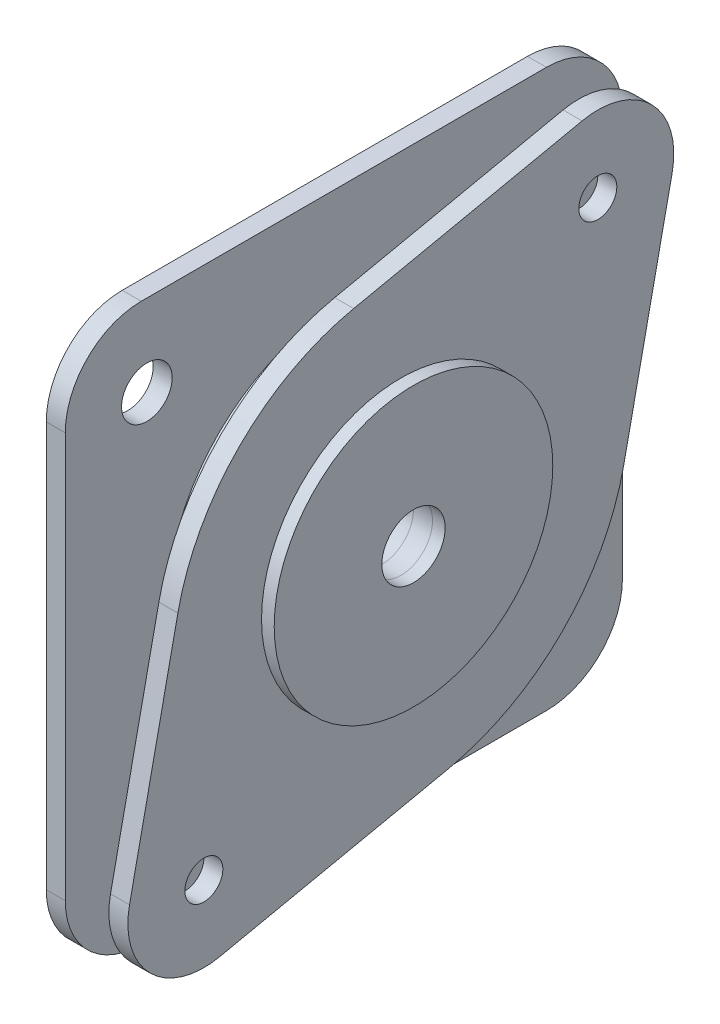
ISO-10303-21;
HEADER;
FILE_DESCRIPTION(('STEP AP214'),'2;1');
FILE_NAME('part.step','',(''),(''),'','','');
FILE_SCHEMA(('AUTOMOTIVE_DESIGN { 1 0 10303 214 1 1 1 1 }'));
ENDSEC;
DATA;
#1=APPLICATION_CONTEXT('core data for automotive mechanical design processes');
#2=APPLICATION_PROTOCOL_DEFINITION('international standard','automotive_design',2000,#1);
#3=PRODUCT_CONTEXT('',#1,'mechanical');
#4=PRODUCT('Part','Part','',(#3));
#5=PRODUCT_RELATED_PRODUCT_CATEGORY('part','',(#4));
#6=PRODUCT_DEFINITION_FORMATION('','',#4);
#7=PRODUCT_DEFINITION_CONTEXT('part definition',#1,'design');
#8=PRODUCT_DEFINITION('design','',#6,#7);
#9=PRODUCT_DEFINITION_SHAPE('','',#8);
#10=(LENGTH_UNIT() NAMED_UNIT(*) SI_UNIT(.MILLI.,.METRE.));
#11=(NAMED_UNIT(*) PLANE_ANGLE_UNIT() SI_UNIT($,.RADIAN.));
#12=(NAMED_UNIT(*) SI_UNIT($,.STERADIAN.) SOLID_ANGLE_UNIT());
#13=UNCERTAINTY_MEASURE_WITH_UNIT(LENGTH_MEASURE(1.E-05),#10,'distance_accuracy_value','');
#14=(GEOMETRIC_REPRESENTATION_CONTEXT(3) GLOBAL_UNCERTAINTY_ASSIGNED_CONTEXT((#13)) GLOBAL_UNIT_ASSIGNED_CONTEXT((#10,
#11,#12)) REPRESENTATION_CONTEXT('',''));
#15=CARTESIAN_POINT('',(0.,0.,0.));
#16=DIRECTION('',(0.,0.,1.));
#17=DIRECTION('',(1.,0.,0.));
#18=AXIS2_PLACEMENT_3D('',#15,#16,#17);
#19=CARTESIAN_POINT('',(1.5,-16.,16.));
#20=DIRECTION('',(1.,0.,0.));
#21=DIRECTION('',(0.,0.,-1.));
#22=AXIS2_PLACEMENT_3D('',#19,#20,#21);
#23=PLANE('',#22);
#24=CARTESIAN_POINT('',(1.5,15.5563491861015,15.556349186104));
#25=DIRECTION('',(1.,0.,0.));
#26=DIRECTION('',(0.,0.,-1.));
#27=AXIS2_PLACEMENT_3D('',#24,#25,#26);
#28=CIRCLE('',#27,2.0000000000026);
#29=CARTESIAN_POINT('',(1.5,15.5563491861015,13.5563491861014));
#30=VERTEX_POINT('',#29);
#31=EDGE_CURVE('E433',#30,#30,#28,.T.);
#32=ORIENTED_EDGE('',*,*,#31,.F.);
#33=EDGE_LOOP('',(#32));
#34=FACE_BOUND('',#33,.T.);
#35=CARTESIAN_POINT('',(1.5,-15.5563491861066,15.5563491861015));
#36=DIRECTION('',(1.,0.,0.));
#37=DIRECTION('',(0.,0.,-1.));
#38=AXIS2_PLACEMENT_3D('',#35,#36,#37);
#39=CIRCLE('',#38,2.0000000000018);
#40=CARTESIAN_POINT('',(1.5,-15.5563491861066,13.5563491860997));
#41=VERTEX_POINT('',#40);
#42=EDGE_CURVE('E503',#41,#41,#39,.T.);
#43=ORIENTED_EDGE('',*,*,#42,.F.);
#44=EDGE_LOOP('',(#43));
#45=FACE_BOUND('',#44,.T.);
#46=CARTESIAN_POINT('',(1.5,-15.5563491861041,-15.5563491861066));
#47=DIRECTION('',(1.,0.,0.));
#48=DIRECTION('',(0.,0.,-1.));
#49=AXIS2_PLACEMENT_3D('',#46,#47,#48);
#50=CIRCLE('',#49,1.99999999999927);
#51=CARTESIAN_POINT('',(1.5,-15.5563491861041,-17.5563491861059));
#52=VERTEX_POINT('',#51);
#53=EDGE_CURVE('E506',#52,#52,#50,.T.);
#54=ORIENTED_EDGE('',*,*,#53,.F.);
#55=EDGE_LOOP('',(#54));
#56=FACE_BOUND('',#55,.T.);
#57=CARTESIAN_POINT('',(1.5,15.556349186104,-15.5563491861041));
#58=DIRECTION('',(1.,0.,0.));
#59=DIRECTION('',(0.,0.,-1.));
#60=AXIS2_PLACEMENT_3D('',#57,#58,#59);
#61=CIRCLE('',#60,2.);
#62=CARTESIAN_POINT('',(1.5,15.556349186104,-17.5563491861041));
#63=VERTEX_POINT('',#62);
#64=EDGE_CURVE('E496',#63,#63,#61,.T.);
#65=ORIENTED_EDGE('',*,*,#64,.F.);
#66=EDGE_LOOP('',(#65));
#67=FACE_BOUND('',#66,.T.);
#68=CARTESIAN_POINT('',(1.5,0.,0.));
#69=DIRECTION('',(1.,0.,0.));
#70=DIRECTION('',(0.,0.,-1.));
#71=AXIS2_PLACEMENT_3D('',#68,#69,#70);
#72=CIRCLE('',#71,14.);
#73=CARTESIAN_POINT('',(1.5,0.,-14.));
#74=VERTEX_POINT('',#73);
#75=EDGE_CURVE('E45',#74,#74,#72,.T.);
#76=ORIENTED_EDGE('',*,*,#75,.F.);
#77=EDGE_LOOP('',(#76));
#78=FACE_BOUND('',#77,.T.);
#79=CARTESIAN_POINT('',(1.5,-16.,16.));
#80=DIRECTION('',(1.,0.,0.));
#81=DIRECTION('',(0.,0.,-1.));
#82=AXIS2_PLACEMENT_3D('',#79,#80,#81);
#83=CIRCLE('',#82,6.);
#84=CARTESIAN_POINT('',(1.5,-16.,22.));
#85=VERTEX_POINT('',#84);
#86=CARTESIAN_POINT('',(1.5,-22.,16.));
#87=VERTEX_POINT('',#86);
#88=EDGE_CURVE('E153',#85,#87,#83,.T.);
#89=ORIENTED_EDGE('',*,*,#88,.T.);
#90=DIRECTION('',(0.,0.,-1.));
#91=VECTOR('',#90,1.);
#92=CARTESIAN_POINT('',(1.5,-22.,16.));
#93=LINE('',#92,#91);
#94=CARTESIAN_POINT('',(1.5,-22.,-16.));
#95=VERTEX_POINT('',#94);
#96=EDGE_CURVE('E99',#87,#95,#93,.T.);
#97=ORIENTED_EDGE('',*,*,#96,.T.);
#98=CARTESIAN_POINT('',(1.5,-16.,-16.));
#99=DIRECTION('',(1.,0.,0.));
#100=DIRECTION('',(0.,0.,-1.));
#101=AXIS2_PLACEMENT_3D('',#98,#99,#100);
#102=CIRCLE('',#101,6.);
#103=CARTESIAN_POINT('',(1.5,-16.,-22.));
#104=VERTEX_POINT('',#103);
#105=EDGE_CURVE('E229',#95,#104,#102,.T.);
#106=ORIENTED_EDGE('',*,*,#105,.T.);
#107=DIRECTION('',(0.,1.,0.));
#108=VECTOR('',#107,1.);
#109=CARTESIAN_POINT('',(1.5,16.,-22.));
#110=LINE('',#109,#108);
#111=CARTESIAN_POINT('',(1.5,16.,-22.));
#112=VERTEX_POINT('',#111);
#113=EDGE_CURVE('E235',#104,#112,#110,.T.);
#114=ORIENTED_EDGE('',*,*,#113,.T.);
#115=CARTESIAN_POINT('',(1.5,16.,-16.));
#116=DIRECTION('',(1.,0.,0.));
#117=DIRECTION('',(0.,0.,1.));
#118=AXIS2_PLACEMENT_3D('',#115,#116,#117);
#119=CIRCLE('',#118,6.);
#120=CARTESIAN_POINT('',(1.5,22.,-16.));
#121=VERTEX_POINT('',#120);
#122=EDGE_CURVE('E120',#112,#121,#119,.T.);
#123=ORIENTED_EDGE('',*,*,#122,.T.);
#124=DIRECTION('',(0.,0.,1.));
#125=VECTOR('',#124,1.);
#126=CARTESIAN_POINT('',(1.5,22.,16.));
#127=LINE('',#126,#125);
#128=CARTESIAN_POINT('',(1.5,22.,16.));
#129=VERTEX_POINT('',#128);
#130=EDGE_CURVE('E115',#121,#129,#127,.T.);
#131=ORIENTED_EDGE('',*,*,#130,.T.);
#132=CARTESIAN_POINT('',(1.5,16.,16.));
#133=DIRECTION('',(1.,0.,0.));
#134=DIRECTION('',(0.,0.,-1.));
#135=AXIS2_PLACEMENT_3D('',#132,#133,#134);
#136=CIRCLE('',#135,6.);
#137=CARTESIAN_POINT('',(1.5,16.,22.));
#138=VERTEX_POINT('',#137);
#139=EDGE_CURVE('E118',#129,#138,#136,.T.);
#140=ORIENTED_EDGE('',*,*,#139,.T.);
#141=DIRECTION('',(0.,-1.,0.));
#142=VECTOR('',#141,1.);
#143=CARTESIAN_POINT('',(1.5,16.,22.));
#144=LINE('',#143,#142);
#145=EDGE_CURVE('E54',#138,#85,#144,.T.);
#146=ORIENTED_EDGE('',*,*,#145,.T.);
#147=EDGE_LOOP('',(#89,#97,#106,#114,#123,#131,#140,#146));
#148=FACE_BOUND('',#147,.T.);
#149=ADVANCED_FACE('F33',(#34,#45,#56,#67,#78,#148),#23,.T.);
#150=CARTESIAN_POINT('',(0.,-16.,16.));
#151=DIRECTION('',(1.,0.,0.));
#152=DIRECTION('',(0.,0.,-1.));
#153=AXIS2_PLACEMENT_3D('',#150,#151,#152);
#154=PLANE('',#153);
#155=CARTESIAN_POINT('',(0.,15.5563491861015,15.556349186104));
#156=DIRECTION('',(1.,0.,0.));
#157=DIRECTION('',(0.,0.,-1.));
#158=AXIS2_PLACEMENT_3D('',#155,#156,#157);
#159=CIRCLE('',#158,2.0000000000026);
#160=CARTESIAN_POINT('',(0.,15.5563491861015,13.5563491861014));
#161=VERTEX_POINT('',#160);
#162=EDGE_CURVE('E438',#161,#161,#159,.T.);
#163=ORIENTED_EDGE('',*,*,#162,.T.);
#164=EDGE_LOOP('',(#163));
#165=FACE_BOUND('',#164,.T.);
#166=CARTESIAN_POINT('',(0.,-15.5563491861066,15.5563491861015));
#167=DIRECTION('',(1.,0.,0.));
#168=DIRECTION('',(0.,0.,-1.));
#169=AXIS2_PLACEMENT_3D('',#166,#167,#168);
#170=CIRCLE('',#169,2.0000000000018);
#171=CARTESIAN_POINT('',(0.,-15.5563491861066,13.5563491860997));
#172=VERTEX_POINT('',#171);
#173=EDGE_CURVE('E500',#172,#172,#170,.T.);
#174=ORIENTED_EDGE('',*,*,#173,.T.);
#175=EDGE_LOOP('',(#174));
#176=FACE_BOUND('',#175,.T.);
#177=CARTESIAN_POINT('',(0.,-15.5563491861041,-15.5563491861066));
#178=DIRECTION('',(1.,0.,0.));
#179=DIRECTION('',(0.,0.,-1.));
#180=AXIS2_PLACEMENT_3D('',#177,#178,#179);
#181=CIRCLE('',#180,1.99999999999927);
#182=CARTESIAN_POINT('',(0.,-15.5563491861041,-17.5563491861059));
#183=VERTEX_POINT('',#182);
#184=EDGE_CURVE('E177',#183,#183,#181,.T.);
#185=ORIENTED_EDGE('',*,*,#184,.T.);
#186=EDGE_LOOP('',(#185));
#187=FACE_BOUND('',#186,.T.);
#188=CARTESIAN_POINT('',(0.,15.556349186104,-15.5563491861041));
#189=DIRECTION('',(1.,0.,0.));
#190=DIRECTION('',(0.,0.,-1.));
#191=AXIS2_PLACEMENT_3D('',#188,#189,#190);
#192=CIRCLE('',#191,2.);
#193=CARTESIAN_POINT('',(0.,15.556349186104,-17.5563491861041));
#194=VERTEX_POINT('',#193);
#195=EDGE_CURVE('E488',#194,#194,#192,.T.);
#196=ORIENTED_EDGE('',*,*,#195,.T.);
#197=EDGE_LOOP('',(#196));
#198=FACE_BOUND('',#197,.T.);
#199=CARTESIAN_POINT('',(0.,-16.,16.));
#200=DIRECTION('',(1.,0.,0.));
#201=DIRECTION('',(0.,0.,-1.));
#202=AXIS2_PLACEMENT_3D('',#199,#200,#201);
#203=CIRCLE('',#202,6.);
#204=CARTESIAN_POINT('',(0.,-16.,22.));
#205=VERTEX_POINT('',#204);
#206=CARTESIAN_POINT('',(0.,-22.,16.));
#207=VERTEX_POINT('',#206);
#208=EDGE_CURVE('E138',#205,#207,#203,.T.);
#209=ORIENTED_EDGE('',*,*,#208,.F.);
#210=DIRECTION('',(0.,-1.,0.));
#211=VECTOR('',#210,1.);
#212=CARTESIAN_POINT('',(0.,16.,22.));
#213=LINE('',#212,#211);
#214=CARTESIAN_POINT('',(0.,16.,22.));
#215=VERTEX_POINT('',#214);
#216=EDGE_CURVE('E90',#215,#205,#213,.T.);
#217=ORIENTED_EDGE('',*,*,#216,.F.);
#218=CARTESIAN_POINT('',(0.,16.,16.));
#219=DIRECTION('',(1.,0.,0.));
#220=DIRECTION('',(0.,0.,-1.));
#221=AXIS2_PLACEMENT_3D('',#218,#219,#220);
#222=CIRCLE('',#221,6.);
#223=CARTESIAN_POINT('',(0.,22.,16.));
#224=VERTEX_POINT('',#223);
#225=EDGE_CURVE('E84',#224,#215,#222,.T.);
#226=ORIENTED_EDGE('',*,*,#225,.F.);
#227=DIRECTION('',(0.,0.,1.));
#228=VECTOR('',#227,1.);
#229=CARTESIAN_POINT('',(0.,22.,16.));
#230=LINE('',#229,#228);
#231=CARTESIAN_POINT('',(0.,22.,-16.));
#232=VERTEX_POINT('',#231);
#233=EDGE_CURVE('E128',#232,#224,#230,.T.);
#234=ORIENTED_EDGE('',*,*,#233,.F.);
#235=CARTESIAN_POINT('',(0.,16.,-16.));
#236=DIRECTION('',(1.,0.,0.));
#237=DIRECTION('',(0.,0.,1.));
#238=AXIS2_PLACEMENT_3D('',#235,#236,#237);
#239=CIRCLE('',#238,6.);
#240=CARTESIAN_POINT('',(0.,16.,-22.));
#241=VERTEX_POINT('',#240);
#242=EDGE_CURVE('E148',#241,#232,#239,.T.);
#243=ORIENTED_EDGE('',*,*,#242,.F.);
#244=DIRECTION('',(0.,1.,0.));
#245=VECTOR('',#244,1.);
#246=CARTESIAN_POINT('',(0.,16.,-22.));
#247=LINE('',#246,#245);
#248=CARTESIAN_POINT('',(0.,-16.,-22.));
#249=VERTEX_POINT('',#248);
#250=EDGE_CURVE('E146',#249,#241,#247,.T.);
#251=ORIENTED_EDGE('',*,*,#250,.F.);
#252=CARTESIAN_POINT('',(0.,-16.,-16.));
#253=DIRECTION('',(1.,0.,0.));
#254=DIRECTION('',(0.,0.,-1.));
#255=AXIS2_PLACEMENT_3D('',#252,#253,#254);
#256=CIRCLE('',#255,6.);
#257=CARTESIAN_POINT('',(0.,-22.,-16.));
#258=VERTEX_POINT('',#257);
#259=EDGE_CURVE('E144',#258,#249,#256,.T.);
#260=ORIENTED_EDGE('',*,*,#259,.F.);
#261=DIRECTION('',(0.,0.,-1.));
#262=VECTOR('',#261,1.);
#263=CARTESIAN_POINT('',(0.,-22.,16.));
#264=LINE('',#263,#262);
#265=EDGE_CURVE('E141',#207,#258,#264,.T.);
#266=ORIENTED_EDGE('',*,*,#265,.F.);
#267=EDGE_LOOP('',(#209,#217,#226,#234,#243,#251,#260,#266));
#268=FACE_BOUND('',#267,.T.);
#269=CARTESIAN_POINT('',(0.,0.,0.));
#270=DIRECTION('',(1.,0.,0.));
#271=DIRECTION('',(0.,0.,-1.));
#272=AXIS2_PLACEMENT_3D('',#269,#270,#271);
#273=CIRCLE('',#272,2.5);
#274=CARTESIAN_POINT('',(0.,0.,-2.5));
#275=VERTEX_POINT('',#274);
#276=EDGE_CURVE('E142',#275,#275,#273,.T.);
#277=ORIENTED_EDGE('',*,*,#276,.T.);
#278=EDGE_LOOP('',(#277));
#279=FACE_BOUND('',#278,.T.);
#280=ADVANCED_FACE('F195',(#165,#176,#187,#198,#268,#279),#154,.F.);
#281=CARTESIAN_POINT('',(1.5,-16.,16.));
#282=DIRECTION('',(-1.,0.,0.));
#283=DIRECTION('',(0.,0.,1.));
#284=AXIS2_PLACEMENT_3D('',#281,#282,#283);
#285=CYLINDRICAL_SURFACE('',#284,6.);
#286=ORIENTED_EDGE('',*,*,#208,.T.);
#287=DIRECTION('',(-1.,0.,0.));
#288=VECTOR('',#287,1.);
#289=CARTESIAN_POINT('',(1.5,-22.,16.));
#290=LINE('',#289,#288);
#291=EDGE_CURVE('E166',#87,#207,#290,.T.);
#292=ORIENTED_EDGE('',*,*,#291,.F.);
#293=ORIENTED_EDGE('',*,*,#88,.F.);
#294=DIRECTION('',(-1.,0.,0.));
#295=VECTOR('',#294,1.);
#296=CARTESIAN_POINT('',(1.5,-16.,22.));
#297=LINE('',#296,#295);
#298=EDGE_CURVE('E134',#85,#205,#297,.T.);
#299=ORIENTED_EDGE('',*,*,#298,.T.);
#300=EDGE_LOOP('',(#286,#292,#293,#299));
#301=FACE_BOUND('',#300,.T.);
#302=ADVANCED_FACE('F35',(#301),#285,.T.);
#303=CARTESIAN_POINT('',(1.5,-22.,16.));
#304=DIRECTION('',(0.,1.,0.));
#305=DIRECTION('',(0.,0.,1.));
#306=AXIS2_PLACEMENT_3D('',#303,#304,#305);
#307=PLANE('',#306);
#308=ORIENTED_EDGE('',*,*,#265,.T.);
#309=DIRECTION('',(-1.,0.,0.));
#310=VECTOR('',#309,1.);
#311=CARTESIAN_POINT('',(1.5,-22.,-16.));
#312=LINE('',#311,#310);
#313=EDGE_CURVE('E163',#95,#258,#312,.T.);
#314=ORIENTED_EDGE('',*,*,#313,.F.);
#315=ORIENTED_EDGE('',*,*,#96,.F.);
#316=ORIENTED_EDGE('',*,*,#291,.T.);
#317=EDGE_LOOP('',(#308,#314,#315,#316));
#318=FACE_BOUND('',#317,.T.);
#319=ADVANCED_FACE('F216',(#318),#307,.F.);
#320=CARTESIAN_POINT('',(1.5,-16.,-16.));
#321=DIRECTION('',(-1.,0.,0.));
#322=DIRECTION('',(0.,0.,1.));
#323=AXIS2_PLACEMENT_3D('',#320,#321,#322);
#324=CYLINDRICAL_SURFACE('',#323,6.);
#325=ORIENTED_EDGE('',*,*,#259,.T.);
#326=DIRECTION('',(-1.,0.,0.));
#327=VECTOR('',#326,1.);
#328=CARTESIAN_POINT('',(1.5,-16.,-22.));
#329=LINE('',#328,#327);
#330=EDGE_CURVE('E160',#104,#249,#329,.T.);
#331=ORIENTED_EDGE('',*,*,#330,.F.);
#332=ORIENTED_EDGE('',*,*,#105,.F.);
#333=ORIENTED_EDGE('',*,*,#313,.T.);
#334=EDGE_LOOP('',(#325,#331,#332,#333));
#335=FACE_BOUND('',#334,.T.);
#336=ADVANCED_FACE('F213',(#335),#324,.T.);
#337=CARTESIAN_POINT('',(1.5,16.,-22.));
#338=DIRECTION('',(0.,0.,1.));
#339=DIRECTION('',(1.,0.,0.));
#340=AXIS2_PLACEMENT_3D('',#337,#338,#339);
#341=PLANE('',#340);
#342=ORIENTED_EDGE('',*,*,#250,.T.);
#343=DIRECTION('',(-1.,0.,0.));
#344=VECTOR('',#343,1.);
#345=CARTESIAN_POINT('',(1.5,16.,-22.));
#346=LINE('',#345,#344);
#347=EDGE_CURVE('E157',#112,#241,#346,.T.);
#348=ORIENTED_EDGE('',*,*,#347,.F.);
#349=ORIENTED_EDGE('',*,*,#113,.F.);
#350=ORIENTED_EDGE('',*,*,#330,.T.);
#351=EDGE_LOOP('',(#342,#348,#349,#350));
#352=FACE_BOUND('',#351,.T.);
#353=ADVANCED_FACE('F209',(#352),#341,.F.);
#354=CARTESIAN_POINT('',(1.5,16.,-16.));
#355=DIRECTION('',(-1.,0.,0.));
#356=DIRECTION('',(0.,0.,1.));
#357=AXIS2_PLACEMENT_3D('',#354,#355,#356);
#358=CYLINDRICAL_SURFACE('',#357,6.);
#359=ORIENTED_EDGE('',*,*,#242,.T.);
#360=DIRECTION('',(-1.,0.,0.));
#361=VECTOR('',#360,1.);
#362=CARTESIAN_POINT('',(1.5,22.,-16.));
#363=LINE('',#362,#361);
#364=EDGE_CURVE('E129',#121,#232,#363,.T.);
#365=ORIENTED_EDGE('',*,*,#364,.F.);
#366=ORIENTED_EDGE('',*,*,#122,.F.);
#367=ORIENTED_EDGE('',*,*,#347,.T.);
#368=EDGE_LOOP('',(#359,#365,#366,#367));
#369=FACE_BOUND('',#368,.T.);
#370=ADVANCED_FACE('F206',(#369),#358,.T.);
#371=CARTESIAN_POINT('',(1.5,22.,16.));
#372=DIRECTION('',(0.,-1.,0.));
#373=DIRECTION('',(0.,0.,-1.));
#374=AXIS2_PLACEMENT_3D('',#371,#372,#373);
#375=PLANE('',#374);
#376=ORIENTED_EDGE('',*,*,#233,.T.);
#377=DIRECTION('',(-1.,0.,0.));
#378=VECTOR('',#377,1.);
#379=CARTESIAN_POINT('',(1.5,22.,16.));
#380=LINE('',#379,#378);
#381=EDGE_CURVE('E125',#129,#224,#380,.T.);
#382=ORIENTED_EDGE('',*,*,#381,.F.);
#383=ORIENTED_EDGE('',*,*,#130,.F.);
#384=ORIENTED_EDGE('',*,*,#364,.T.);
#385=EDGE_LOOP('',(#376,#382,#383,#384));
#386=FACE_BOUND('',#385,.T.);
#387=ADVANCED_FACE('F126',(#386),#375,.F.);
#388=CARTESIAN_POINT('',(1.5,16.,16.));
#389=DIRECTION('',(-1.,0.,0.));
#390=DIRECTION('',(0.,0.,1.));
#391=AXIS2_PLACEMENT_3D('',#388,#389,#390);
#392=CYLINDRICAL_SURFACE('',#391,6.);
#393=ORIENTED_EDGE('',*,*,#225,.T.);
#394=DIRECTION('',(-1.,0.,0.));
#395=VECTOR('',#394,1.);
#396=CARTESIAN_POINT('',(1.5,16.,22.));
#397=LINE('',#396,#395);
#398=EDGE_CURVE('E130',#138,#215,#397,.T.);
#399=ORIENTED_EDGE('',*,*,#398,.F.);
#400=ORIENTED_EDGE('',*,*,#139,.F.);
#401=ORIENTED_EDGE('',*,*,#381,.T.);
#402=EDGE_LOOP('',(#393,#399,#400,#401));
#403=FACE_BOUND('',#402,.T.);
#404=ADVANCED_FACE('F132',(#403),#392,.T.);
#405=CARTESIAN_POINT('',(1.5,16.,22.));
#406=DIRECTION('',(0.,0.,-1.));
#407=DIRECTION('',(-1.,0.,0.));
#408=AXIS2_PLACEMENT_3D('',#405,#406,#407);
#409=PLANE('',#408);
#410=ORIENTED_EDGE('',*,*,#216,.T.);
#411=ORIENTED_EDGE('',*,*,#298,.F.);
#412=ORIENTED_EDGE('',*,*,#145,.F.);
#413=ORIENTED_EDGE('',*,*,#398,.T.);
#414=EDGE_LOOP('',(#410,#411,#412,#413));
#415=FACE_BOUND('',#414,.T.);
#416=ADVANCED_FACE('F190',(#415),#409,.F.);
#417=CARTESIAN_POINT('',(1.5,0.,0.));
#418=DIRECTION('',(-1.,0.,0.));
#419=DIRECTION('',(0.,0.,1.));
#420=AXIS2_PLACEMENT_3D('',#417,#418,#419);
#421=CYLINDRICAL_SURFACE('',#420,2.5);
#422=ORIENTED_EDGE('',*,*,#276,.F.);
#423=EDGE_LOOP('',(#422));
#424=FACE_BOUND('',#423,.T.);
#425=CARTESIAN_POINT('',(4.5,0.,0.));
#426=DIRECTION('',(1.,0.,0.));
#427=DIRECTION('',(0.,0.,1.));
#428=AXIS2_PLACEMENT_3D('',#425,#426,#427);
#429=CIRCLE('',#428,2.5);
#430=CARTESIAN_POINT('',(4.5,0.,2.5));
#431=VERTEX_POINT('',#430);
#432=EDGE_CURVE('E172',#431,#431,#429,.T.);
#433=ORIENTED_EDGE('',*,*,#432,.T.);
#434=EDGE_LOOP('',(#433));
#435=FACE_BOUND('',#434,.T.);
#436=ADVANCED_FACE('F179',(#424,#435),#421,.F.);
#437=CARTESIAN_POINT('',(4.5,0.,0.));
#438=DIRECTION('',(-1.,0.,0.));
#439=DIRECTION('',(0.,0.,1.));
#440=AXIS2_PLACEMENT_3D('',#437,#438,#439);
#441=CYLINDRICAL_SURFACE('',#440,14.);
#442=CARTESIAN_POINT('',(4.5,0.,0.));
#443=DIRECTION('',(1.,0.,0.));
#444=DIRECTION('',(0.,0.,-1.));
#445=AXIS2_PLACEMENT_3D('',#442,#443,#444);
#446=CIRCLE('',#445,14.);
#447=CARTESIAN_POINT('',(4.5,0.,-14.));
#448=VERTEX_POINT('',#447);
#449=EDGE_CURVE('E243',#448,#448,#446,.T.);
#450=ORIENTED_EDGE('',*,*,#449,.F.);
#451=EDGE_LOOP('',(#450));
#452=FACE_BOUND('',#451,.T.);
#453=ORIENTED_EDGE('',*,*,#75,.T.);
#454=EDGE_LOOP('',(#453));
#455=FACE_BOUND('',#454,.T.);
#456=ADVANCED_FACE('F189',(#452,#455),#441,.T.);
#457=CARTESIAN_POINT('',(4.5,0.,-0.002));
#458=DIRECTION('',(1.,0.,0.));
#459=DIRECTION('',(0.,0.,-1.));
#460=AXIS2_PLACEMENT_3D('',#457,#458,#459);
#461=PLANE('',#460);
#462=CARTESIAN_POINT('',(4.5,0.,-0.002));
#463=DIRECTION('',(1.,0.,0.));
#464=DIRECTION('',(0.,0.,-1.));
#465=AXIS2_PLACEMENT_3D('',#462,#463,#464);
#466=CIRCLE('',#465,18.);
#467=CARTESIAN_POINT('',(4.5,17.6102050587483,3.72367816495693));
#468=VERTEX_POINT('',#467);
#469=CARTESIAN_POINT('',(4.5,3.72692559108058,17.6079411026428));
#470=VERTEX_POINT('',#469);
#471=EDGE_CURVE('E312',#468,#470,#466,.T.);
#472=ORIENTED_EDGE('',*,*,#471,.F.);
#473=DIRECTION('',(0.,-0.206982120275385,0.978344725486015));
#474=VECTOR('',#473,1.);
#475=CARTESIAN_POINT('',(4.5,17.6102050587483,3.72367816495693));
#476=LINE('',#475,#474);
#477=CARTESIAN_POINT('',(4.5,21.4264175390201,-14.3144564644518));
#478=VERTEX_POINT('',#477);
#479=EDGE_CURVE('E346',#478,#468,#476,.T.);
#480=ORIENTED_EDGE('',*,*,#479,.F.);
#481=CARTESIAN_POINT('',(4.5,15.556349186104,-15.5563491861041));
#482=DIRECTION('',(1.,0.,0.));
#483=DIRECTION('',(0.,0.,-1.));
#484=AXIS2_PLACEMENT_3D('',#481,#482,#483);
#485=CIRCLE('',#484,6.);
#486=CARTESIAN_POINT('',(4.5,14.3152112078002,-21.42657716454));
#487=VERTEX_POINT('',#486);
#488=EDGE_CURVE('E343',#487,#478,#485,.T.);
#489=ORIENTED_EDGE('',*,*,#488,.F.);
#490=DIRECTION('',(0.,0.978371329739319,-0.20685632971731));
#491=VECTOR('',#490,1.);
#492=CARTESIAN_POINT('',(4.5,-3.72341393491158,-17.6126839353077));
#493=LINE('',#492,#491);
#494=CARTESIAN_POINT('',(4.5,-3.72341393491159,-17.6126839353077));
#495=VERTEX_POINT('',#494);
#496=EDGE_CURVE('E340',#495,#487,#493,.T.);
#497=ORIENTED_EDGE('',*,*,#496,.F.);
#498=CARTESIAN_POINT('',(4.5,0.,-0.002));
#499=DIRECTION('',(1.,0.,0.));
#500=DIRECTION('',(0.,0.,-1.));
#501=AXIS2_PLACEMENT_3D('',#498,#499,#500);
#502=CIRCLE('',#501,18.);
#503=CARTESIAN_POINT('',(4.5,-17.610358594453,-3.72695237214854));
#504=VERTEX_POINT('',#503);
#505=EDGE_CURVE('E337',#504,#495,#502,.T.);
#506=ORIENTED_EDGE('',*,*,#505,.F.);
#507=DIRECTION('',(0.,0.206941798452697,-0.978353255247389));
#508=VECTOR('',#507,1.);
#509=CARTESIAN_POINT('',(4.5,-17.610358594453,-3.72695237214854));
#510=LINE('',#509,#508);
#511=CARTESIAN_POINT('',(4.5,-21.426487839487,14.3144607074678));
#512=VERTEX_POINT('',#511);
#513=EDGE_CURVE('E334',#512,#504,#510,.T.);
#514=ORIENTED_EDGE('',*,*,#513,.F.);
#515=CARTESIAN_POINT('',(4.5,-15.5563683080027,15.556111498184));
#516=DIRECTION('',(1.,0.,0.));
#517=DIRECTION('',(0.,0.,-1.));
#518=AXIS2_PLACEMENT_3D('',#515,#516,#517);
#519=CIRCLE('',#518,6.);
#520=CARTESIAN_POINT('',(4.5,-14.3140597776425,21.4260918657316));
#521=VERTEX_POINT('',#520);
#522=EDGE_CURVE('E325',#521,#512,#519,.T.);
#523=ORIENTED_EDGE('',*,*,#522,.F.);
#524=DIRECTION('',(0.,-0.978330061257934,0.207051421726699));
#525=VECTOR('',#524,1.);
#526=CARTESIAN_POINT('',(4.5,3.72692559108058,17.6079411026428));
#527=LINE('',#526,#525);
#528=EDGE_CURVE('E322',#470,#521,#527,.T.);
#529=ORIENTED_EDGE('',*,*,#528,.F.);
#530=EDGE_LOOP('',(#472,#480,#489,#497,#506,#514,#523,#529));
#531=FACE_BOUND('',#530,.T.);
#532=ORIENTED_EDGE('',*,*,#449,.T.);
#533=EDGE_LOOP('',(#532));
#534=FACE_BOUND('',#533,.T.);
#535=CARTESIAN_POINT('',(4.5,15.556349186104,-15.5563491861041));
#536=DIRECTION('',(1.,0.,0.));
#537=DIRECTION('',(0.,0.,-1.));
#538=AXIS2_PLACEMENT_3D('',#535,#536,#537);
#539=CIRCLE('',#538,1.5);
#540=CARTESIAN_POINT('',(4.5,15.556349186104,-17.0563491861041));
#541=VERTEX_POINT('',#540);
#542=EDGE_CURVE('E386',#541,#541,#539,.T.);
#543=ORIENTED_EDGE('',*,*,#542,.T.);
#544=EDGE_LOOP('',(#543));
#545=FACE_BOUND('',#544,.T.);
#546=CARTESIAN_POINT('',(4.5,-15.5563491861039,15.5543491861042));
#547=DIRECTION('',(1.,0.,0.));
#548=DIRECTION('',(0.,0.,-1.));
#549=AXIS2_PLACEMENT_3D('',#546,#547,#548);
#550=CIRCLE('',#549,1.5);
#551=CARTESIAN_POINT('',(4.5,-15.5563491861039,14.0543491861042));
#552=VERTEX_POINT('',#551);
#553=EDGE_CURVE('E430',#552,#552,#550,.T.);
#554=ORIENTED_EDGE('',*,*,#553,.T.);
#555=EDGE_LOOP('',(#554));
#556=FACE_BOUND('',#555,.T.);
#557=ADVANCED_FACE('F272',(#531,#534,#545,#556),#461,.F.);
#558=CARTESIAN_POINT('',(6.,0.,-0.002));
#559=DIRECTION('',(1.,0.,0.));
#560=DIRECTION('',(0.,0.,-1.));
#561=AXIS2_PLACEMENT_3D('',#558,#559,#560);
#562=PLANE('',#561);
#563=CARTESIAN_POINT('',(6.,0.,0.));
#564=DIRECTION('',(1.,0.,0.));
#565=DIRECTION('',(0.,0.,-1.));
#566=AXIS2_PLACEMENT_3D('',#563,#564,#565);
#567=CIRCLE('',#566,11.);
#568=CARTESIAN_POINT('',(6.,0.,-11.));
#569=VERTEX_POINT('',#568);
#570=EDGE_CURVE('E11',#569,#569,#567,.T.);
#571=ORIENTED_EDGE('',*,*,#570,.F.);
#572=EDGE_LOOP('',(#571));
#573=FACE_BOUND('',#572,.T.);
#574=CARTESIAN_POINT('',(6.,15.556349186104,-15.5563491861041));
#575=DIRECTION('',(1.,0.,0.));
#576=DIRECTION('',(0.,0.,-1.));
#577=AXIS2_PLACEMENT_3D('',#574,#575,#576);
#578=CIRCLE('',#577,1.5);
#579=CARTESIAN_POINT('',(6.,15.556349186104,-17.0563491861041));
#580=VERTEX_POINT('',#579);
#581=EDGE_CURVE('E327',#580,#580,#578,.T.);
#582=ORIENTED_EDGE('',*,*,#581,.F.);
#583=EDGE_LOOP('',(#582));
#584=FACE_BOUND('',#583,.T.);
#585=CARTESIAN_POINT('',(6.,0.,-0.002));
#586=DIRECTION('',(1.,0.,0.));
#587=DIRECTION('',(0.,0.,-1.));
#588=AXIS2_PLACEMENT_3D('',#585,#586,#587);
#589=CIRCLE('',#588,18.);
#590=CARTESIAN_POINT('',(6.,17.6102050587483,3.72367816495693));
#591=VERTEX_POINT('',#590);
#592=CARTESIAN_POINT('',(6.,3.72692559108058,17.6079411026428));
#593=VERTEX_POINT('',#592);
#594=EDGE_CURVE('E349',#591,#593,#589,.T.);
#595=ORIENTED_EDGE('',*,*,#594,.T.);
#596=DIRECTION('',(0.,-0.978330061257934,0.207051421726699));
#597=VECTOR('',#596,1.);
#598=CARTESIAN_POINT('',(6.,3.72692559108058,17.6079411026428));
#599=LINE('',#598,#597);
#600=CARTESIAN_POINT('',(6.,-14.3140597776425,21.4260918657316));
#601=VERTEX_POINT('',#600);
#602=EDGE_CURVE('E371',#593,#601,#599,.T.);
#603=ORIENTED_EDGE('',*,*,#602,.T.);
#604=CARTESIAN_POINT('',(6.,-15.5563683080027,15.556111498184));
#605=DIRECTION('',(1.,0.,0.));
#606=DIRECTION('',(0.,0.,-1.));
#607=AXIS2_PLACEMENT_3D('',#604,#605,#606);
#608=CIRCLE('',#607,6.);
#609=CARTESIAN_POINT('',(6.,-21.426487839487,14.3144607074678));
#610=VERTEX_POINT('',#609);
#611=EDGE_CURVE('E378',#601,#610,#608,.T.);
#612=ORIENTED_EDGE('',*,*,#611,.T.);
#613=DIRECTION('',(0.,0.206941798452697,-0.978353255247389));
#614=VECTOR('',#613,1.);
#615=CARTESIAN_POINT('',(6.,-17.610358594453,-3.72695237214854));
#616=LINE('',#615,#614);
#617=CARTESIAN_POINT('',(6.,-17.610358594453,-3.72695237214854));
#618=VERTEX_POINT('',#617);
#619=EDGE_CURVE('E390',#610,#618,#616,.T.);
#620=ORIENTED_EDGE('',*,*,#619,.T.);
#621=CARTESIAN_POINT('',(6.,0.,-0.002));
#622=DIRECTION('',(1.,0.,0.));
#623=DIRECTION('',(0.,0.,-1.));
#624=AXIS2_PLACEMENT_3D('',#621,#622,#623);
#625=CIRCLE('',#624,18.);
#626=CARTESIAN_POINT('',(6.,-3.72341393491159,-17.6126839353077));
#627=VERTEX_POINT('',#626);
#628=EDGE_CURVE('E393',#618,#627,#625,.T.);
#629=ORIENTED_EDGE('',*,*,#628,.T.);
#630=DIRECTION('',(0.,0.978371329739319,-0.20685632971731));
#631=VECTOR('',#630,1.);
#632=CARTESIAN_POINT('',(6.,-3.72341393491158,-17.6126839353077));
#633=LINE('',#632,#631);
#634=CARTESIAN_POINT('',(6.,14.3152112078002,-21.42657716454));
#635=VERTEX_POINT('',#634);
#636=EDGE_CURVE('E396',#627,#635,#633,.T.);
#637=ORIENTED_EDGE('',*,*,#636,.T.);
#638=CARTESIAN_POINT('',(6.,15.556349186104,-15.5563491861041));
#639=DIRECTION('',(1.,0.,0.));
#640=DIRECTION('',(0.,0.,-1.));
#641=AXIS2_PLACEMENT_3D('',#638,#639,#640);
#642=CIRCLE('',#641,6.);
#643=CARTESIAN_POINT('',(6.,21.4264175390201,-14.3144564644518));
#644=VERTEX_POINT('',#643);
#645=EDGE_CURVE('E398',#635,#644,#642,.T.);
#646=ORIENTED_EDGE('',*,*,#645,.T.);
#647=DIRECTION('',(0.,-0.206982120275385,0.978344725486015));
#648=VECTOR('',#647,1.);
#649=CARTESIAN_POINT('',(6.,17.6102050587483,3.72367816495693));
#650=LINE('',#649,#648);
#651=EDGE_CURVE('E329',#644,#591,#650,.T.);
#652=ORIENTED_EDGE('',*,*,#651,.T.);
#653=EDGE_LOOP('',(#595,#603,#612,#620,#629,#637,#646,#652));
#654=FACE_BOUND('',#653,.T.);
#655=CARTESIAN_POINT('',(6.,-15.5563491861039,15.5543491861042));
#656=DIRECTION('',(1.,0.,0.));
#657=DIRECTION('',(0.,0.,-1.));
#658=AXIS2_PLACEMENT_3D('',#655,#656,#657);
#659=CIRCLE('',#658,1.5);
#660=CARTESIAN_POINT('',(6.,-15.5563491861039,14.0543491861042));
#661=VERTEX_POINT('',#660);
#662=EDGE_CURVE('E432',#661,#661,#659,.T.);
#663=ORIENTED_EDGE('',*,*,#662,.F.);
#664=EDGE_LOOP('',(#663));
#665=FACE_BOUND('',#664,.T.);
#666=ADVANCED_FACE('F267',(#573,#584,#654,#665),#562,.T.);
#667=CARTESIAN_POINT('',(6.,0.,-0.002));
#668=DIRECTION('',(-1.,0.,0.));
#669=DIRECTION('',(0.,0.,1.));
#670=AXIS2_PLACEMENT_3D('',#667,#668,#669);
#671=CYLINDRICAL_SURFACE('',#670,18.);
#672=ORIENTED_EDGE('',*,*,#471,.T.);
#673=DIRECTION('',(-1.,0.,0.));
#674=VECTOR('',#673,1.);
#675=CARTESIAN_POINT('',(6.,3.72692559108058,17.6079411026428));
#676=LINE('',#675,#674);
#677=EDGE_CURVE('E248',#593,#470,#676,.T.);
#678=ORIENTED_EDGE('',*,*,#677,.F.);
#679=ORIENTED_EDGE('',*,*,#594,.F.);
#680=DIRECTION('',(-1.,0.,0.));
#681=VECTOR('',#680,1.);
#682=CARTESIAN_POINT('',(6.,17.6102050587483,3.72367816495693));
#683=LINE('',#682,#681);
#684=EDGE_CURVE('E317',#591,#468,#683,.T.);
#685=ORIENTED_EDGE('',*,*,#684,.T.);
#686=EDGE_LOOP('',(#672,#678,#679,#685));
#687=FACE_BOUND('',#686,.T.);
#688=ADVANCED_FACE('F271',(#687),#671,.T.);
#689=CARTESIAN_POINT('',(6.,3.72692559108058,17.6079411026428));
#690=DIRECTION('',(0.,-0.207051421726699,-0.978330061257934));
#691=DIRECTION('',(0.,0.978330061257934,-0.207051421726699));
#692=AXIS2_PLACEMENT_3D('',#689,#690,#691);
#693=PLANE('',#692);
#694=ORIENTED_EDGE('',*,*,#528,.T.);
#695=DIRECTION('',(-1.,0.,0.));
#696=VECTOR('',#695,1.);
#697=CARTESIAN_POINT('',(6.,-14.3140597776425,21.4260918657316));
#698=LINE('',#697,#696);
#699=EDGE_CURVE('E366',#601,#521,#698,.T.);
#700=ORIENTED_EDGE('',*,*,#699,.F.);
#701=ORIENTED_EDGE('',*,*,#602,.F.);
#702=ORIENTED_EDGE('',*,*,#677,.T.);
#703=EDGE_LOOP('',(#694,#700,#701,#702));
#704=FACE_BOUND('',#703,.T.);
#705=ADVANCED_FACE('F299',(#704),#693,.F.);
#706=CARTESIAN_POINT('',(6.,-15.5563683080027,15.556111498184));
#707=DIRECTION('',(-1.,0.,0.));
#708=DIRECTION('',(0.,0.,1.));
#709=AXIS2_PLACEMENT_3D('',#706,#707,#708);
#710=CYLINDRICAL_SURFACE('',#709,6.);
#711=ORIENTED_EDGE('',*,*,#522,.T.);
#712=DIRECTION('',(-1.,0.,0.));
#713=VECTOR('',#712,1.);
#714=CARTESIAN_POINT('',(6.,-21.426487839487,14.3144607074678));
#715=LINE('',#714,#713);
#716=EDGE_CURVE('E363',#610,#512,#715,.T.);
#717=ORIENTED_EDGE('',*,*,#716,.F.);
#718=ORIENTED_EDGE('',*,*,#611,.F.);
#719=ORIENTED_EDGE('',*,*,#699,.T.);
#720=EDGE_LOOP('',(#711,#717,#718,#719));
#721=FACE_BOUND('',#720,.T.);
#722=ADVANCED_FACE('F295',(#721),#710,.T.);
#723=CARTESIAN_POINT('',(6.,-17.610358594453,-3.72695237214854));
#724=DIRECTION('',(0.,0.978353255247389,0.206941798452697));
#725=DIRECTION('',(0.,-0.206941798452697,0.978353255247389));
#726=AXIS2_PLACEMENT_3D('',#723,#724,#725);
#727=PLANE('',#726);
#728=ORIENTED_EDGE('',*,*,#513,.T.);
#729=DIRECTION('',(-1.,0.,0.));
#730=VECTOR('',#729,1.);
#731=CARTESIAN_POINT('',(6.,-17.610358594453,-3.72695237214854));
#732=LINE('',#731,#730);
#733=EDGE_CURVE('E360',#618,#504,#732,.T.);
#734=ORIENTED_EDGE('',*,*,#733,.F.);
#735=ORIENTED_EDGE('',*,*,#619,.F.);
#736=ORIENTED_EDGE('',*,*,#716,.T.);
#737=EDGE_LOOP('',(#728,#734,#735,#736));
#738=FACE_BOUND('',#737,.T.);
#739=ADVANCED_FACE('F291',(#738),#727,.F.);
#740=CARTESIAN_POINT('',(6.,0.,-0.002));
#741=DIRECTION('',(-1.,0.,0.));
#742=DIRECTION('',(0.,0.,1.));
#743=AXIS2_PLACEMENT_3D('',#740,#741,#742);
#744=CYLINDRICAL_SURFACE('',#743,18.);
#745=ORIENTED_EDGE('',*,*,#505,.T.);
#746=DIRECTION('',(-1.,0.,0.));
#747=VECTOR('',#746,1.);
#748=CARTESIAN_POINT('',(6.,-3.72341393491159,-17.6126839353077));
#749=LINE('',#748,#747);
#750=EDGE_CURVE('E357',#627,#495,#749,.T.);
#751=ORIENTED_EDGE('',*,*,#750,.F.);
#752=ORIENTED_EDGE('',*,*,#628,.F.);
#753=ORIENTED_EDGE('',*,*,#733,.T.);
#754=EDGE_LOOP('',(#745,#751,#752,#753));
#755=FACE_BOUND('',#754,.T.);
#756=ADVANCED_FACE('F287',(#755),#744,.T.);
#757=CARTESIAN_POINT('',(6.,-3.72341393491158,-17.6126839353077));
#758=DIRECTION('',(0.,0.20685632971731,0.978371329739319));
#759=DIRECTION('',(0.,-0.978371329739319,0.20685632971731));
#760=AXIS2_PLACEMENT_3D('',#757,#758,#759);
#761=PLANE('',#760);
#762=ORIENTED_EDGE('',*,*,#496,.T.);
#763=DIRECTION('',(-1.,0.,0.));
#764=VECTOR('',#763,1.);
#765=CARTESIAN_POINT('',(6.,14.3152112078002,-21.42657716454));
#766=LINE('',#765,#764);
#767=EDGE_CURVE('E354',#635,#487,#766,.T.);
#768=ORIENTED_EDGE('',*,*,#767,.F.);
#769=ORIENTED_EDGE('',*,*,#636,.F.);
#770=ORIENTED_EDGE('',*,*,#750,.T.);
#771=EDGE_LOOP('',(#762,#768,#769,#770));
#772=FACE_BOUND('',#771,.T.);
#773=ADVANCED_FACE('F283',(#772),#761,.F.);
#774=CARTESIAN_POINT('',(6.,15.556349186104,-15.5563491861041));
#775=DIRECTION('',(-1.,0.,0.));
#776=DIRECTION('',(0.,0.,1.));
#777=AXIS2_PLACEMENT_3D('',#774,#775,#776);
#778=CYLINDRICAL_SURFACE('',#777,6.);
#779=ORIENTED_EDGE('',*,*,#488,.T.);
#780=DIRECTION('',(-1.,0.,0.));
#781=VECTOR('',#780,1.);
#782=CARTESIAN_POINT('',(6.,21.4264175390201,-14.3144564644518));
#783=LINE('',#782,#781);
#784=EDGE_CURVE('E351',#644,#478,#783,.T.);
#785=ORIENTED_EDGE('',*,*,#784,.F.);
#786=ORIENTED_EDGE('',*,*,#645,.F.);
#787=ORIENTED_EDGE('',*,*,#767,.T.);
#788=EDGE_LOOP('',(#779,#785,#786,#787));
#789=FACE_BOUND('',#788,.T.);
#790=ADVANCED_FACE('F279',(#789),#778,.T.);
#791=CARTESIAN_POINT('',(6.,17.6102050587483,3.72367816495693));
#792=DIRECTION('',(0.,-0.978344725486015,-0.206982120275385));
#793=DIRECTION('',(0.,0.206982120275385,-0.978344725486015));
#794=AXIS2_PLACEMENT_3D('',#791,#792,#793);
#795=PLANE('',#794);
#796=ORIENTED_EDGE('',*,*,#479,.T.);
#797=ORIENTED_EDGE('',*,*,#684,.F.);
#798=ORIENTED_EDGE('',*,*,#651,.F.);
#799=ORIENTED_EDGE('',*,*,#784,.T.);
#800=EDGE_LOOP('',(#796,#797,#798,#799));
#801=FACE_BOUND('',#800,.T.);
#802=ADVANCED_FACE('F264',(#801),#795,.F.);
#803=CARTESIAN_POINT('',(6.,0.,-0.002));
#804=DIRECTION('',(-1.,0.,0.));
#805=DIRECTION('',(0.,0.,1.));
#806=AXIS2_PLACEMENT_3D('',#803,#804,#805);
#807=CYLINDRICAL_SURFACE('',#806,2.502);
#808=CARTESIAN_POINT('',(6.,0.,-0.002));
#809=DIRECTION('',(1.,0.,0.));
#810=DIRECTION('',(0.,0.,1.));
#811=AXIS2_PLACEMENT_3D('',#808,#809,#810);
#812=CIRCLE('',#811,2.502);
#813=CARTESIAN_POINT('',(6.,0.,2.5));
#814=VERTEX_POINT('',#813);
#815=EDGE_CURVE('E497',#814,#814,#812,.T.);
#816=ORIENTED_EDGE('',*,*,#815,.T.);
#817=EDGE_LOOP('',(#816));
#818=FACE_BOUND('',#817,.T.);
#819=ORIENTED_EDGE('',*,*,#432,.F.);
#820=EDGE_LOOP('',(#819));
#821=FACE_BOUND('',#820,.T.);
#822=ADVANCED_FACE('F253',(#818,#821),#807,.F.);
#823=CARTESIAN_POINT('',(6.,15.556349186104,-15.5563491861041));
#824=DIRECTION('',(-1.,0.,0.));
#825=DIRECTION('',(0.,0.,1.));
#826=AXIS2_PLACEMENT_3D('',#823,#824,#825);
#827=CYLINDRICAL_SURFACE('',#826,1.5);
#828=ORIENTED_EDGE('',*,*,#581,.T.);
#829=EDGE_LOOP('',(#828));
#830=FACE_BOUND('',#829,.T.);
#831=ORIENTED_EDGE('',*,*,#542,.F.);
#832=EDGE_LOOP('',(#831));
#833=FACE_BOUND('',#832,.T.);
#834=ADVANCED_FACE('F263',(#830,#833),#827,.F.);
#835=CARTESIAN_POINT('',(6.,-15.5563491861039,15.5543491861042));
#836=DIRECTION('',(-1.,0.,0.));
#837=DIRECTION('',(0.,0.,1.));
#838=AXIS2_PLACEMENT_3D('',#835,#836,#837);
#839=CYLINDRICAL_SURFACE('',#838,1.5);
#840=ORIENTED_EDGE('',*,*,#662,.T.);
#841=EDGE_LOOP('',(#840));
#842=FACE_BOUND('',#841,.T.);
#843=ORIENTED_EDGE('',*,*,#553,.F.);
#844=EDGE_LOOP('',(#843));
#845=FACE_BOUND('',#844,.T.);
#846=ADVANCED_FACE('F446',(#842,#845),#839,.F.);
#847=CARTESIAN_POINT('',(-3.,15.556349186104,-15.5563491861041));
#848=DIRECTION('',(1.,0.,0.));
#849=DIRECTION('',(0.,0.,-1.));
#850=AXIS2_PLACEMENT_3D('',#847,#848,#849);
#851=CYLINDRICAL_SURFACE('',#850,2.);
#852=ORIENTED_EDGE('',*,*,#64,.T.);
#853=EDGE_LOOP('',(#852));
#854=FACE_BOUND('',#853,.T.);
#855=ORIENTED_EDGE('',*,*,#195,.F.);
#856=EDGE_LOOP('',(#855));
#857=FACE_BOUND('',#856,.T.);
#858=ADVANCED_FACE('F450',(#854,#857),#851,.F.);
#859=CARTESIAN_POINT('',(-3.,-15.5563491861041,-15.5563491861066));
#860=DIRECTION('',(1.,0.,0.));
#861=DIRECTION('',(0.,0.,-1.));
#862=AXIS2_PLACEMENT_3D('',#859,#860,#861);
#863=CYLINDRICAL_SURFACE('',#862,1.99999999999927);
#864=ORIENTED_EDGE('',*,*,#53,.T.);
#865=EDGE_LOOP('',(#864));
#866=FACE_BOUND('',#865,.T.);
#867=ORIENTED_EDGE('',*,*,#184,.F.);
#868=EDGE_LOOP('',(#867));
#869=FACE_BOUND('',#868,.T.);
#870=ADVANCED_FACE('F455',(#866,#869),#863,.F.);
#871=CARTESIAN_POINT('',(-3.,-15.5563491861066,15.5563491861015));
#872=DIRECTION('',(1.,0.,0.));
#873=DIRECTION('',(0.,0.,-1.));
#874=AXIS2_PLACEMENT_3D('',#871,#872,#873);
#875=CYLINDRICAL_SURFACE('',#874,2.0000000000018);
#876=ORIENTED_EDGE('',*,*,#42,.T.);
#877=EDGE_LOOP('',(#876));
#878=FACE_BOUND('',#877,.T.);
#879=ORIENTED_EDGE('',*,*,#173,.F.);
#880=EDGE_LOOP('',(#879));
#881=FACE_BOUND('',#880,.T.);
#882=ADVANCED_FACE('F463',(#878,#881),#875,.F.);
#883=CARTESIAN_POINT('',(-3.,15.5563491861015,15.556349186104));
#884=DIRECTION('',(1.,0.,0.));
#885=DIRECTION('',(0.,0.,-1.));
#886=AXIS2_PLACEMENT_3D('',#883,#884,#885);
#887=CYLINDRICAL_SURFACE('',#886,2.0000000000026);
#888=ORIENTED_EDGE('',*,*,#31,.T.);
#889=EDGE_LOOP('',(#888));
#890=FACE_BOUND('',#889,.T.);
#891=ORIENTED_EDGE('',*,*,#162,.F.);
#892=EDGE_LOOP('',(#891));
#893=FACE_BOUND('',#892,.T.);
#894=ADVANCED_FACE('F459',(#890,#893),#887,.F.);
#895=CARTESIAN_POINT('',(7.,0.,0.));
#896=DIRECTION('',(1.,0.,0.));
#897=DIRECTION('',(0.,0.,-1.));
#898=AXIS2_PLACEMENT_3D('',#895,#896,#897);
#899=PLANE('',#898);
#900=CARTESIAN_POINT('',(7.,0.,0.));
#901=DIRECTION('',(1.,0.,0.));
#902=DIRECTION('',(0.,0.,-1.));
#903=AXIS2_PLACEMENT_3D('',#900,#901,#902);
#904=CIRCLE('',#903,11.);
#905=CARTESIAN_POINT('',(7.,0.,-11.));
#906=VERTEX_POINT('',#905);
#907=EDGE_CURVE('E521',#906,#906,#904,.T.);
#908=ORIENTED_EDGE('',*,*,#907,.T.);
#909=EDGE_LOOP('',(#908));
#910=FACE_BOUND('',#909,.T.);
#911=CARTESIAN_POINT('',(7.,0.,0.));
#912=DIRECTION('',(1.,0.,0.));
#913=DIRECTION('',(0.,0.,-1.));
#914=AXIS2_PLACEMENT_3D('',#911,#912,#913);
#915=CIRCLE('',#914,2.5);
#916=CARTESIAN_POINT('',(7.,0.,-2.5));
#917=VERTEX_POINT('',#916);
#918=EDGE_CURVE('E523',#917,#917,#915,.T.);
#919=ORIENTED_EDGE('',*,*,#918,.F.);
#920=EDGE_LOOP('',(#919));
#921=FACE_BOUND('',#920,.T.);
#922=ADVANCED_FACE('F462',(#910,#921),#899,.T.);
#923=CARTESIAN_POINT('',(7.,0.,0.));
#924=DIRECTION('',(-1.,0.,0.));
#925=DIRECTION('',(0.,0.,1.));
#926=AXIS2_PLACEMENT_3D('',#923,#924,#925);
#927=CYLINDRICAL_SURFACE('',#926,11.);
#928=ORIENTED_EDGE('',*,*,#907,.F.);
#929=EDGE_LOOP('',(#928));
#930=FACE_BOUND('',#929,.T.);
#931=ORIENTED_EDGE('',*,*,#570,.T.);
#932=EDGE_LOOP('',(#931));
#933=FACE_BOUND('',#932,.T.);
#934=ADVANCED_FACE('F471',(#930,#933),#927,.T.);
#935=CARTESIAN_POINT('',(7.,0.,0.));
#936=DIRECTION('',(-1.,0.,0.));
#937=DIRECTION('',(0.,0.,1.));
#938=AXIS2_PLACEMENT_3D('',#935,#936,#937);
#939=CYLINDRICAL_SURFACE('',#938,2.5);
#940=ORIENTED_EDGE('',*,*,#918,.T.);
#941=EDGE_LOOP('',(#940));
#942=FACE_BOUND('',#941,.T.);
#943=ORIENTED_EDGE('',*,*,#815,.F.);
#944=EDGE_LOOP('',(#943));
#945=FACE_BOUND('',#944,.T.);
#946=ADVANCED_FACE('F474',(#942,#945),#939,.F.);
#947=CLOSED_SHELL('',(#149,#280,#302,#319,#336,#353,#370,#387,#404,#416,#436,#456,#557,#666,
#688,#705,#722,#739,#756,#773,#790,#802,#822,#834,#846,#858,#870,#882,#894,#922,#934,#946));
#948=MANIFOLD_SOLID_BREP('B2',#947);
#949=ADVANCED_BREP_SHAPE_REPRESENTATION('',(#18,#948),#14);
#950=SHAPE_DEFINITION_REPRESENTATION(#9,#949);
ENDSEC;
END-ISO-10303-21;
